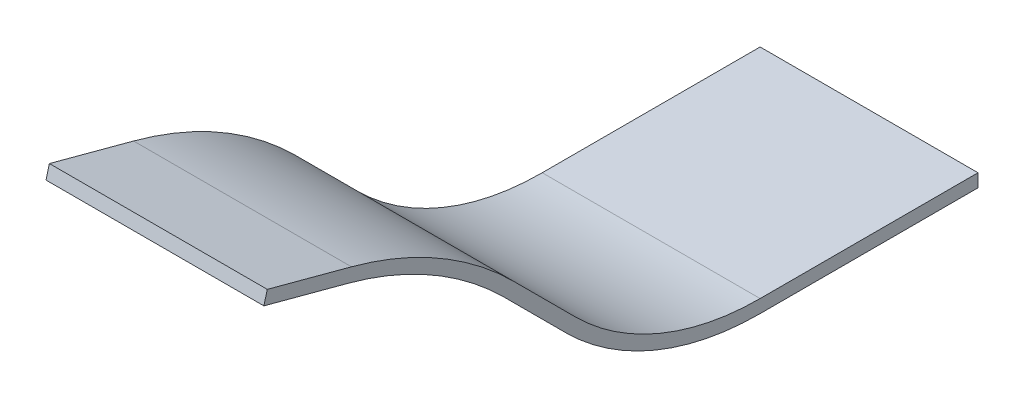
ISO-10303-21;
HEADER;
FILE_DESCRIPTION(('STEP AP214'),'2;1');
FILE_NAME('part.step','',(''),(''),'','','');
FILE_SCHEMA(('AUTOMOTIVE_DESIGN { 1 0 10303 214 1 1 1 1 }'));
ENDSEC;
DATA;
#1=APPLICATION_CONTEXT('core data for automotive mechanical design processes');
#2=APPLICATION_PROTOCOL_DEFINITION('international standard','automotive_design',2000,#1);
#3=PRODUCT_CONTEXT('',#1,'mechanical');
#4=PRODUCT('Part','Part','',(#3));
#5=PRODUCT_RELATED_PRODUCT_CATEGORY('part','',(#4));
#6=PRODUCT_DEFINITION_FORMATION('','',#4);
#7=PRODUCT_DEFINITION_CONTEXT('part definition',#1,'design');
#8=PRODUCT_DEFINITION('design','',#6,#7);
#9=PRODUCT_DEFINITION_SHAPE('','',#8);
#10=(LENGTH_UNIT() NAMED_UNIT(*) SI_UNIT(.MILLI.,.METRE.));
#11=(NAMED_UNIT(*) PLANE_ANGLE_UNIT() SI_UNIT($,.RADIAN.));
#12=(NAMED_UNIT(*) SI_UNIT($,.STERADIAN.) SOLID_ANGLE_UNIT());
#13=UNCERTAINTY_MEASURE_WITH_UNIT(LENGTH_MEASURE(1.E-05),#10,'distance_accuracy_value','');
#14=(GEOMETRIC_REPRESENTATION_CONTEXT(3) GLOBAL_UNCERTAINTY_ASSIGNED_CONTEXT((#13)) GLOBAL_UNIT_ASSIGNED_CONTEXT((#10,
#11,#12)) REPRESENTATION_CONTEXT('',''));
#15=CARTESIAN_POINT('',(0.,0.,0.));
#16=DIRECTION('',(0.,0.,1.));
#17=DIRECTION('',(1.,0.,0.));
#18=AXIS2_PLACEMENT_3D('',#15,#16,#17);
#19=CARTESIAN_POINT('',(-255.551417898459,-239.741340859453,1395.53432975078));
#20=DIRECTION('',(1.,0.,0.));
#21=DIRECTION('',(0.,0.707106781186547,0.707106781186548));
#22=AXIS2_PLACEMENT_3D('',#19,#20,#21);
#23=CYLINDRICAL_SURFACE('',#22,800.);
#24=CARTESIAN_POINT('',(244.448582102109,-239.741340859453,1395.53432975078));
#25=DIRECTION('',(1.,0.,0.));
#26=DIRECTION('',(0.,0.,-1.));
#27=AXIS2_PLACEMENT_3D('',#24,#25,#26);
#28=CIRCLE('',#27,800.);
#29=CARTESIAN_POINT('',(244.448582102109,532.999320171803,1188.47909366876));
#30=VERTEX_POINT('',#29);
#31=CARTESIAN_POINT('',(244.448582102109,325.944084089785,829.848904801541));
#32=VERTEX_POINT('',#31);
#33=EDGE_CURVE('E148',#30,#32,#28,.F.);
#34=ORIENTED_EDGE('',*,*,#33,.F.);
#35=DIRECTION('',(-1.,0.,0.));
#36=VECTOR('',#35,1.);
#37=CARTESIAN_POINT('',(0.,532.999320171803,1188.47909366876));
#38=LINE('',#37,#36);
#39=CARTESIAN_POINT('',(-255.551417897891,532.999320171803,1188.47909366876));
#40=VERTEX_POINT('',#39);
#41=EDGE_CURVE('E13',#30,#40,#38,.T.);
#42=ORIENTED_EDGE('',*,*,#41,.T.);
#43=CARTESIAN_POINT('',(-255.551417897891,-239.741340859453,1395.53432975078));
#44=DIRECTION('',(1.,0.,0.));
#45=DIRECTION('',(0.,0.,-1.));
#46=AXIS2_PLACEMENT_3D('',#43,#44,#45);
#47=CIRCLE('',#46,800.);
#48=CARTESIAN_POINT('',(-255.551417897891,325.944084089785,829.848904801541));
#49=VERTEX_POINT('',#48);
#50=EDGE_CURVE('E312',#49,#40,#47,.T.);
#51=ORIENTED_EDGE('',*,*,#50,.F.);
#52=DIRECTION('',(-1.,0.,0.));
#53=VECTOR('',#52,1.);
#54=CARTESIAN_POINT('',(0.,325.944084089785,829.848904801541));
#55=LINE('',#54,#53);
#56=EDGE_CURVE('E309',#32,#49,#55,.T.);
#57=ORIENTED_EDGE('',*,*,#56,.F.);
#58=EDGE_LOOP('',(#34,#42,#51,#57));
#59=FACE_BOUND('',#58,.T.);
#60=ADVANCED_FACE('F144',(#59),#23,.F.);
#61=CARTESIAN_POINT('',(244.448582102109,146.968601643979,-368.118260314079));
#62=DIRECTION('',(-1.,0.,0.));
#63=DIRECTION('',(0.,0.258819045102521,0.965925826289068));
#64=AXIS2_PLACEMENT_3D('',#61,#62,#63);
#65=PLANE('',#64);
#66=DIRECTION('',(0.,-0.258819045102521,-0.965925826289068));
#67=VECTOR('',#66,1.);
#68=CARTESIAN_POINT('',(244.448582102109,117.990826855307,-360.353688961004));
#69=LINE('',#68,#67);
#70=CARTESIAN_POINT('',(244.448582102109,584.763129192307,1381.66425892658));
#71=VERTEX_POINT('',#70);
#72=EDGE_CURVE('E154',#71,#30,#69,.T.);
#73=ORIENTED_EDGE('',*,*,#72,.T.);
#74=ORIENTED_EDGE('',*,*,#33,.T.);
#75=DIRECTION('',(0.,-0.707106781186549,-0.707106781186546));
#76=VECTOR('',#75,1.);
#77=CARTESIAN_POINT('',(244.448582102109,-507.245126408105,-3.34030569634647));
#78=LINE('',#77,#76);
#79=CARTESIAN_POINT('',(244.448582102109,184.522727852476,688.427548564233));
#80=VERTEX_POINT('',#79);
#81=EDGE_CURVE('E229',#32,#80,#78,.T.);
#82=ORIENTED_EDGE('',*,*,#81,.T.);
#83=CARTESIAN_POINT('',(244.448582102109,630.,242.950276416707));
#84=DIRECTION('',(1.,0.,0.));
#85=DIRECTION('',(0.,0.,1.));
#86=AXIS2_PLACEMENT_3D('',#83,#84,#85);
#87=CIRCLE('',#86,630.);
#88=CARTESIAN_POINT('',(244.448582102109,0.,242.950276416707));
#89=VERTEX_POINT('',#88);
#90=EDGE_CURVE('E234',#80,#89,#87,.T.);
#91=ORIENTED_EDGE('',*,*,#90,.T.);
#92=DIRECTION('',(0.,0.,-1.));
#93=VECTOR('',#92,1.);
#94=CARTESIAN_POINT('',(244.448582102109,0.,-257.049723583293));
#95=LINE('',#94,#93);
#96=CARTESIAN_POINT('',(244.448582102109,-1.11022302462516E-13,-257.049723583294));
#97=VERTEX_POINT('',#96);
#98=EDGE_CURVE('E251',#89,#97,#95,.T.);
#99=ORIENTED_EDGE('',*,*,#98,.T.);
#100=DIRECTION('',(0.,-1.,0.));
#101=VECTOR('',#100,1.);
#102=CARTESIAN_POINT('',(244.448582102109,30.,-257.049723583293));
#103=LINE('',#102,#101);
#104=CARTESIAN_POINT('',(244.448582102109,29.9999999999998,-257.049723583293));
#105=VERTEX_POINT('',#104);
#106=EDGE_CURVE('E266',#105,#97,#103,.T.);
#107=ORIENTED_EDGE('',*,*,#106,.F.);
#108=DIRECTION('',(0.,0.,-1.));
#109=VECTOR('',#108,1.);
#110=CARTESIAN_POINT('',(244.448582102109,30.,-257.049723583293));
#111=LINE('',#110,#109);
#112=CARTESIAN_POINT('',(244.448582102109,30.,242.950276416706));
#113=VERTEX_POINT('',#112);
#114=EDGE_CURVE('E291',#113,#105,#111,.T.);
#115=ORIENTED_EDGE('',*,*,#114,.F.);
#116=CARTESIAN_POINT('',(244.448582102109,630.,242.950276416707));
#117=DIRECTION('',(1.,0.,0.));
#118=DIRECTION('',(0.,0.,1.));
#119=AXIS2_PLACEMENT_3D('',#116,#117,#118);
#120=CIRCLE('',#119,600.);
#121=CARTESIAN_POINT('',(244.448582102109,205.735931288072,667.214345128636));
#122=VERTEX_POINT('',#121);
#123=EDGE_CURVE('E352',#122,#113,#120,.T.);
#124=ORIENTED_EDGE('',*,*,#123,.F.);
#125=DIRECTION('',(0.,-0.707106781186549,-0.707106781186546));
#126=VECTOR('',#125,1.);
#127=CARTESIAN_POINT('',(244.448582102109,-486.031922972509,-24.5535091319429));
#128=LINE('',#127,#126);
#129=CARTESIAN_POINT('',(244.448582102109,347.157287525381,808.635701365945));
#130=VERTEX_POINT('',#129);
#131=EDGE_CURVE('E333',#130,#122,#128,.T.);
#132=ORIENTED_EDGE('',*,*,#131,.F.);
#133=CARTESIAN_POINT('',(244.448582102109,-239.741340859453,1395.53432975078));
#134=DIRECTION('',(1.,0.,0.));
#135=DIRECTION('',(0.,0.,-1.));
#136=AXIS2_PLACEMENT_3D('',#133,#134,#135);
#137=CIRCLE('',#136,830.);
#138=CARTESIAN_POINT('',(244.448582102109,561.977094960475,1180.71452231569));
#139=VERTEX_POINT('',#138);
#140=EDGE_CURVE('E306',#139,#130,#137,.F.);
#141=ORIENTED_EDGE('',*,*,#140,.F.);
#142=DIRECTION('',(0.,-0.258819045102521,-0.965925826289068));
#143=VECTOR('',#142,1.);
#144=CARTESIAN_POINT('',(244.448582102109,146.968601643979,-368.118260314079));
#145=LINE('',#144,#143);
#146=CARTESIAN_POINT('',(244.448582102109,613.74090398098,1373.8996875735));
#147=VERTEX_POINT('',#146);
#148=EDGE_CURVE('E324',#147,#139,#145,.T.);
#149=ORIENTED_EDGE('',*,*,#148,.F.);
#150=DIRECTION('',(0.,-0.965925826289068,0.258819045102521));
#151=VECTOR('',#150,1.);
#152=CARTESIAN_POINT('',(244.448582102109,613.74090398098,1373.8996875735));
#153=LINE('',#152,#151);
#154=EDGE_CURVE('E323',#147,#71,#153,.T.);
#155=ORIENTED_EDGE('',*,*,#154,.T.);
#156=EDGE_LOOP('',(#73,#74,#82,#91,#99,#107,#115,#124,#132,#141,#149,#155));
#157=FACE_BOUND('',#156,.T.);
#158=ADVANCED_FACE('F231',(#157),#65,.F.);
#159=CARTESIAN_POINT('',(-255.551417897891,146.968601643979,-368.118260314079));
#160=DIRECTION('',(1.,0.,0.));
#161=DIRECTION('',(0.,-0.258819045102521,-0.965925826289068));
#162=AXIS2_PLACEMENT_3D('',#159,#160,#161);
#163=PLANE('',#162);
#164=DIRECTION('',(0.,0.258819045102521,0.965925826289068));
#165=VECTOR('',#164,1.);
#166=CARTESIAN_POINT('',(-255.551417897891,146.968601643979,-368.118260314079));
#167=LINE('',#166,#165);
#168=CARTESIAN_POINT('',(-255.551417897891,561.977094960475,1180.71452231569));
#169=VERTEX_POINT('',#168);
#170=CARTESIAN_POINT('',(-255.551417897891,613.74090398098,1373.8996875735));
#171=VERTEX_POINT('',#170);
#172=EDGE_CURVE('E343',#169,#171,#167,.T.);
#173=ORIENTED_EDGE('',*,*,#172,.F.);
#174=CARTESIAN_POINT('',(-255.551417897891,-239.741340859453,1395.53432975078));
#175=DIRECTION('',(1.,0.,0.));
#176=DIRECTION('',(0.,0.,-1.));
#177=AXIS2_PLACEMENT_3D('',#174,#175,#176);
#178=CIRCLE('',#177,830.);
#179=CARTESIAN_POINT('',(-255.551417897891,347.157287525381,808.635701365945));
#180=VERTEX_POINT('',#179);
#181=EDGE_CURVE('E311',#180,#169,#178,.T.);
#182=ORIENTED_EDGE('',*,*,#181,.F.);
#183=DIRECTION('',(0.,0.707106781186549,0.707106781186546));
#184=VECTOR('',#183,1.);
#185=CARTESIAN_POINT('',(-255.551417897891,-486.031922972509,-24.5535091319429));
#186=LINE('',#185,#184);
#187=CARTESIAN_POINT('',(-255.551417897891,205.735931288072,667.214345128636));
#188=VERTEX_POINT('',#187);
#189=EDGE_CURVE('E339',#188,#180,#186,.T.);
#190=ORIENTED_EDGE('',*,*,#189,.F.);
#191=CARTESIAN_POINT('',(-255.551417897891,630.,242.950276416707));
#192=DIRECTION('',(-1.,0.,0.));
#193=DIRECTION('',(0.,0.,1.));
#194=AXIS2_PLACEMENT_3D('',#191,#192,#193);
#195=CIRCLE('',#194,600.);
#196=CARTESIAN_POINT('',(-255.551417897891,30.,242.950276416706));
#197=VERTEX_POINT('',#196);
#198=EDGE_CURVE('E265',#197,#188,#195,.T.);
#199=ORIENTED_EDGE('',*,*,#198,.F.);
#200=DIRECTION('',(0.,0.,1.));
#201=VECTOR('',#200,1.);
#202=CARTESIAN_POINT('',(-255.551417897891,30.,-257.049723583293));
#203=LINE('',#202,#201);
#204=CARTESIAN_POINT('',(-255.551417897891,29.9999999999998,-257.049723583293));
#205=VERTEX_POINT('',#204);
#206=EDGE_CURVE('E299',#205,#197,#203,.T.);
#207=ORIENTED_EDGE('',*,*,#206,.F.);
#208=DIRECTION('',(0.,-1.,0.));
#209=VECTOR('',#208,1.);
#210=CARTESIAN_POINT('',(-255.551417897891,30.,-257.049723583293));
#211=LINE('',#210,#209);
#212=CARTESIAN_POINT('',(-255.551417897891,-1.11022302462516E-13,-257.049723583294));
#213=VERTEX_POINT('',#212);
#214=EDGE_CURVE('E253',#205,#213,#211,.T.);
#215=ORIENTED_EDGE('',*,*,#214,.T.);
#216=DIRECTION('',(0.,0.,1.));
#217=VECTOR('',#216,1.);
#218=CARTESIAN_POINT('',(-255.551417897891,0.,-257.049723583293));
#219=LINE('',#218,#217);
#220=CARTESIAN_POINT('',(-255.551417897891,0.,242.950276416707));
#221=VERTEX_POINT('',#220);
#222=EDGE_CURVE('E276',#213,#221,#219,.T.);
#223=ORIENTED_EDGE('',*,*,#222,.T.);
#224=CARTESIAN_POINT('',(-255.551417897891,630.,242.950276416707));
#225=DIRECTION('',(-1.,0.,0.));
#226=DIRECTION('',(0.,0.,1.));
#227=AXIS2_PLACEMENT_3D('',#224,#225,#226);
#228=CIRCLE('',#227,630.);
#229=CARTESIAN_POINT('',(-255.551417897891,184.522727852476,688.427548564233));
#230=VERTEX_POINT('',#229);
#231=EDGE_CURVE('E281',#221,#230,#228,.T.);
#232=ORIENTED_EDGE('',*,*,#231,.T.);
#233=DIRECTION('',(0.,0.707106781186549,0.707106781186546));
#234=VECTOR('',#233,1.);
#235=CARTESIAN_POINT('',(-255.551417897891,-507.245126408105,-3.34030569634647));
#236=LINE('',#235,#234);
#237=EDGE_CURVE('E244',#230,#49,#236,.T.);
#238=ORIENTED_EDGE('',*,*,#237,.T.);
#239=ORIENTED_EDGE('',*,*,#50,.T.);
#240=DIRECTION('',(0.,0.258819045102521,0.965925826289068));
#241=VECTOR('',#240,1.);
#242=CARTESIAN_POINT('',(-255.551417897891,117.990826855307,-360.353688961004));
#243=LINE('',#242,#241);
#244=CARTESIAN_POINT('',(-255.551417897891,584.763129192307,1381.66425892658));
#245=VERTEX_POINT('',#244);
#246=EDGE_CURVE('E320',#40,#245,#243,.T.);
#247=ORIENTED_EDGE('',*,*,#246,.T.);
#248=DIRECTION('',(0.,-0.965925826289068,0.258819045102521));
#249=VECTOR('',#248,1.);
#250=CARTESIAN_POINT('',(-255.551417897891,613.74090398098,1373.8996875735));
#251=LINE('',#250,#249);
#252=EDGE_CURVE('E286',#171,#245,#251,.T.);
#253=ORIENTED_EDGE('',*,*,#252,.F.);
#254=EDGE_LOOP('',(#173,#182,#190,#199,#207,#215,#223,#232,#238,#239,#247,#253));
#255=FACE_BOUND('',#254,.T.);
#256=ADVANCED_FACE('F317',(#255),#163,.F.);
#257=CARTESIAN_POINT('',(0.,213.497965645674,-119.82729366451));
#258=DIRECTION('',(0.,-0.965925826289068,0.258819045102521));
#259=DIRECTION('',(0.,-0.258819045102521,-0.965925826289068));
#260=AXIS2_PLACEMENT_3D('',#257,#258,#259);
#261=PLANE('',#260);
#262=ORIENTED_EDGE('',*,*,#148,.T.);
#263=DIRECTION('',(-1.,0.,0.));
#264=VECTOR('',#263,1.);
#265=CARTESIAN_POINT('',(0.,561.977094960475,1180.71452231569));
#266=LINE('',#265,#264);
#267=EDGE_CURVE('E328',#139,#169,#266,.T.);
#268=ORIENTED_EDGE('',*,*,#267,.T.);
#269=ORIENTED_EDGE('',*,*,#172,.T.);
#270=DIRECTION('',(1.,0.,0.));
#271=VECTOR('',#270,1.);
#272=CARTESIAN_POINT('',(244.448582102109,613.74090398098,1373.8996875735));
#273=LINE('',#272,#271);
#274=EDGE_CURVE('E346',#171,#147,#273,.T.);
#275=ORIENTED_EDGE('',*,*,#274,.T.);
#276=EDGE_LOOP('',(#262,#268,#269,#275));
#277=FACE_BOUND('',#276,.T.);
#278=ADVANCED_FACE('F396',(#277),#261,.F.);
#279=CARTESIAN_POINT('',(0.,-325.483523760231,178.421296951527));
#280=DIRECTION('',(0.,-0.707106781186546,0.707106781186549));
#281=DIRECTION('',(0.,-0.707106781186549,-0.707106781186546));
#282=AXIS2_PLACEMENT_3D('',#279,#280,#281);
#283=PLANE('',#282);
#284=ORIENTED_EDGE('',*,*,#81,.F.);
#285=ORIENTED_EDGE('',*,*,#56,.T.);
#286=ORIENTED_EDGE('',*,*,#237,.F.);
#287=DIRECTION('',(-1.,0.,0.));
#288=VECTOR('',#287,1.);
#289=CARTESIAN_POINT('',(0.,184.522727852476,688.427548564233));
#290=LINE('',#289,#288);
#291=EDGE_CURVE('E240',#80,#230,#290,.T.);
#292=ORIENTED_EDGE('',*,*,#291,.F.);
#293=EDGE_LOOP('',(#284,#285,#286,#292));
#294=FACE_BOUND('',#293,.T.);
#295=ADVANCED_FACE('F243',(#294),#283,.T.);
#296=CARTESIAN_POINT('',(-255.551417898459,-239.741340859453,1395.53432975078));
#297=DIRECTION('',(1.,0.,0.));
#298=DIRECTION('',(0.,0.707106781186547,0.707106781186548));
#299=AXIS2_PLACEMENT_3D('',#296,#297,#298);
#300=CYLINDRICAL_SURFACE('',#299,830.);
#301=ORIENTED_EDGE('',*,*,#267,.F.);
#302=ORIENTED_EDGE('',*,*,#140,.T.);
#303=DIRECTION('',(-1.,0.,0.));
#304=VECTOR('',#303,1.);
#305=CARTESIAN_POINT('',(0.,347.157287525382,808.635701365945));
#306=LINE('',#305,#304);
#307=EDGE_CURVE('E310',#130,#180,#306,.T.);
#308=ORIENTED_EDGE('',*,*,#307,.T.);
#309=ORIENTED_EDGE('',*,*,#181,.T.);
#310=EDGE_LOOP('',(#301,#302,#308,#309));
#311=FACE_BOUND('',#310,.T.);
#312=ADVANCED_FACE('F390',(#311),#300,.T.);
#313=CARTESIAN_POINT('',(244.448582101541,630.,242.950276416707));
#314=DIRECTION('',(-1.,0.,0.));
#315=DIRECTION('',(0.,0.,1.));
#316=AXIS2_PLACEMENT_3D('',#313,#314,#315);
#317=CYLINDRICAL_SURFACE('',#316,630.);
#318=ORIENTED_EDGE('',*,*,#90,.F.);
#319=ORIENTED_EDGE('',*,*,#291,.T.);
#320=ORIENTED_EDGE('',*,*,#231,.F.);
#321=DIRECTION('',(-1.,0.,0.));
#322=VECTOR('',#321,1.);
#323=CARTESIAN_POINT('',(0.,0.,242.950276416707));
#324=LINE('',#323,#322);
#325=EDGE_CURVE('E250',#89,#221,#324,.T.);
#326=ORIENTED_EDGE('',*,*,#325,.F.);
#327=EDGE_LOOP('',(#318,#319,#320,#326));
#328=FACE_BOUND('',#327,.T.);
#329=ADVANCED_FACE('F249',(#328),#317,.T.);
#330=CARTESIAN_POINT('',(0.,-304.270320324635,157.208093515931));
#331=DIRECTION('',(0.,-0.707106781186546,0.707106781186549));
#332=DIRECTION('',(0.,-0.707106781186549,-0.707106781186546));
#333=AXIS2_PLACEMENT_3D('',#330,#331,#332);
#334=PLANE('',#333);
#335=ORIENTED_EDGE('',*,*,#307,.F.);
#336=ORIENTED_EDGE('',*,*,#131,.T.);
#337=DIRECTION('',(-1.,0.,0.));
#338=VECTOR('',#337,1.);
#339=CARTESIAN_POINT('',(0.,205.735931288072,667.214345128636));
#340=LINE('',#339,#338);
#341=EDGE_CURVE('E336',#122,#188,#340,.T.);
#342=ORIENTED_EDGE('',*,*,#341,.T.);
#343=ORIENTED_EDGE('',*,*,#189,.T.);
#344=EDGE_LOOP('',(#335,#336,#342,#343));
#345=FACE_BOUND('',#344,.T.);
#346=ADVANCED_FACE('F385',(#345),#334,.F.);
#347=CARTESIAN_POINT('',(0.,0.,0.));
#348=DIRECTION('',(0.,-1.,0.));
#349=DIRECTION('',(0.,0.,-1.));
#350=AXIS2_PLACEMENT_3D('',#347,#348,#349);
#351=PLANE('',#350);
#352=ORIENTED_EDGE('',*,*,#98,.F.);
#353=ORIENTED_EDGE('',*,*,#325,.T.);
#354=ORIENTED_EDGE('',*,*,#222,.F.);
#355=DIRECTION('',(-1.,0.,0.));
#356=VECTOR('',#355,1.);
#357=CARTESIAN_POINT('',(244.448582102109,0.,-257.049723583293));
#358=LINE('',#357,#356);
#359=EDGE_CURVE('E263',#97,#213,#358,.T.);
#360=ORIENTED_EDGE('',*,*,#359,.F.);
#361=EDGE_LOOP('',(#352,#353,#354,#360));
#362=FACE_BOUND('',#361,.T.);
#363=ADVANCED_FACE('F371',(#362),#351,.T.);
#364=CARTESIAN_POINT('',(244.448582101541,630.,242.950276416707));
#365=DIRECTION('',(-1.,0.,0.));
#366=DIRECTION('',(0.,0.,1.));
#367=AXIS2_PLACEMENT_3D('',#364,#365,#366);
#368=CYLINDRICAL_SURFACE('',#367,600.);
#369=ORIENTED_EDGE('',*,*,#341,.F.);
#370=ORIENTED_EDGE('',*,*,#123,.T.);
#371=DIRECTION('',(-1.,0.,0.));
#372=VECTOR('',#371,1.);
#373=CARTESIAN_POINT('',(0.,30.,242.950276416707));
#374=LINE('',#373,#372);
#375=EDGE_CURVE('E357',#113,#197,#374,.T.);
#376=ORIENTED_EDGE('',*,*,#375,.T.);
#377=ORIENTED_EDGE('',*,*,#198,.T.);
#378=EDGE_LOOP('',(#369,#370,#376,#377));
#379=FACE_BOUND('',#378,.T.);
#380=ADVANCED_FACE('F383',(#379),#368,.F.);
#381=CARTESIAN_POINT('',(244.448582102109,30.,-257.049723583293));
#382=DIRECTION('',(0.,0.,1.));
#383=DIRECTION('',(1.,0.,0.));
#384=AXIS2_PLACEMENT_3D('',#381,#382,#383);
#385=PLANE('',#384);
#386=ORIENTED_EDGE('',*,*,#359,.T.);
#387=ORIENTED_EDGE('',*,*,#214,.F.);
#388=DIRECTION('',(-1.,0.,0.));
#389=VECTOR('',#388,1.);
#390=CARTESIAN_POINT('',(244.448582102109,30.,-257.049723583293));
#391=LINE('',#390,#389);
#392=EDGE_CURVE('E295',#105,#205,#391,.T.);
#393=ORIENTED_EDGE('',*,*,#392,.F.);
#394=ORIENTED_EDGE('',*,*,#106,.T.);
#395=EDGE_LOOP('',(#386,#387,#393,#394));
#396=FACE_BOUND('',#395,.T.);
#397=ADVANCED_FACE('F376',(#396),#385,.F.);
#398=CARTESIAN_POINT('',(244.448582102109,613.74090398098,1373.8996875735));
#399=DIRECTION('',(0.,-0.258819045102521,-0.965925826289068));
#400=DIRECTION('',(-1.,0.,0.));
#401=AXIS2_PLACEMENT_3D('',#398,#399,#400);
#402=PLANE('',#401);
#403=DIRECTION('',(1.,0.,0.));
#404=VECTOR('',#403,1.);
#405=CARTESIAN_POINT('',(244.448582102109,584.763129192307,1381.66425892658));
#406=LINE('',#405,#404);
#407=EDGE_CURVE('E271',#245,#71,#406,.T.);
#408=ORIENTED_EDGE('',*,*,#407,.T.);
#409=ORIENTED_EDGE('',*,*,#154,.F.);
#410=ORIENTED_EDGE('',*,*,#274,.F.);
#411=ORIENTED_EDGE('',*,*,#252,.T.);
#412=EDGE_LOOP('',(#408,#409,#410,#411));
#413=FACE_BOUND('',#412,.T.);
#414=ADVANCED_FACE('F395',(#413),#402,.F.);
#415=CARTESIAN_POINT('',(0.,30.,0.));
#416=DIRECTION('',(0.,-1.,0.));
#417=DIRECTION('',(0.,0.,-1.));
#418=AXIS2_PLACEMENT_3D('',#415,#416,#417);
#419=PLANE('',#418);
#420=ORIENTED_EDGE('',*,*,#375,.F.);
#421=ORIENTED_EDGE('',*,*,#114,.T.);
#422=ORIENTED_EDGE('',*,*,#392,.T.);
#423=ORIENTED_EDGE('',*,*,#206,.T.);
#424=EDGE_LOOP('',(#420,#421,#422,#423));
#425=FACE_BOUND('',#424,.T.);
#426=ADVANCED_FACE('F378',(#425),#419,.F.);
#427=CARTESIAN_POINT('',(0.,184.520190857002,-112.062722311435));
#428=DIRECTION('',(0.,-0.965925826289068,0.258819045102521));
#429=DIRECTION('',(0.,-0.258819045102521,-0.965925826289068));
#430=AXIS2_PLACEMENT_3D('',#427,#428,#429);
#431=PLANE('',#430);
#432=ORIENTED_EDGE('',*,*,#41,.F.);
#433=ORIENTED_EDGE('',*,*,#72,.F.);
#434=ORIENTED_EDGE('',*,*,#407,.F.);
#435=ORIENTED_EDGE('',*,*,#246,.F.);
#436=EDGE_LOOP('',(#432,#433,#434,#435));
#437=FACE_BOUND('',#436,.T.);
#438=ADVANCED_FACE('F146',(#437),#431,.T.);
#439=CLOSED_SHELL('',(#60,#158,#256,#278,#295,#312,#329,#346,#363,#380,#397,#414,#426,#438));
#440=MANIFOLD_SOLID_BREP('B2',#439);
#441=ADVANCED_BREP_SHAPE_REPRESENTATION('',(#18,#440),#14);
#442=SHAPE_DEFINITION_REPRESENTATION(#9,#441);
ENDSEC;
END-ISO-10303-21;
